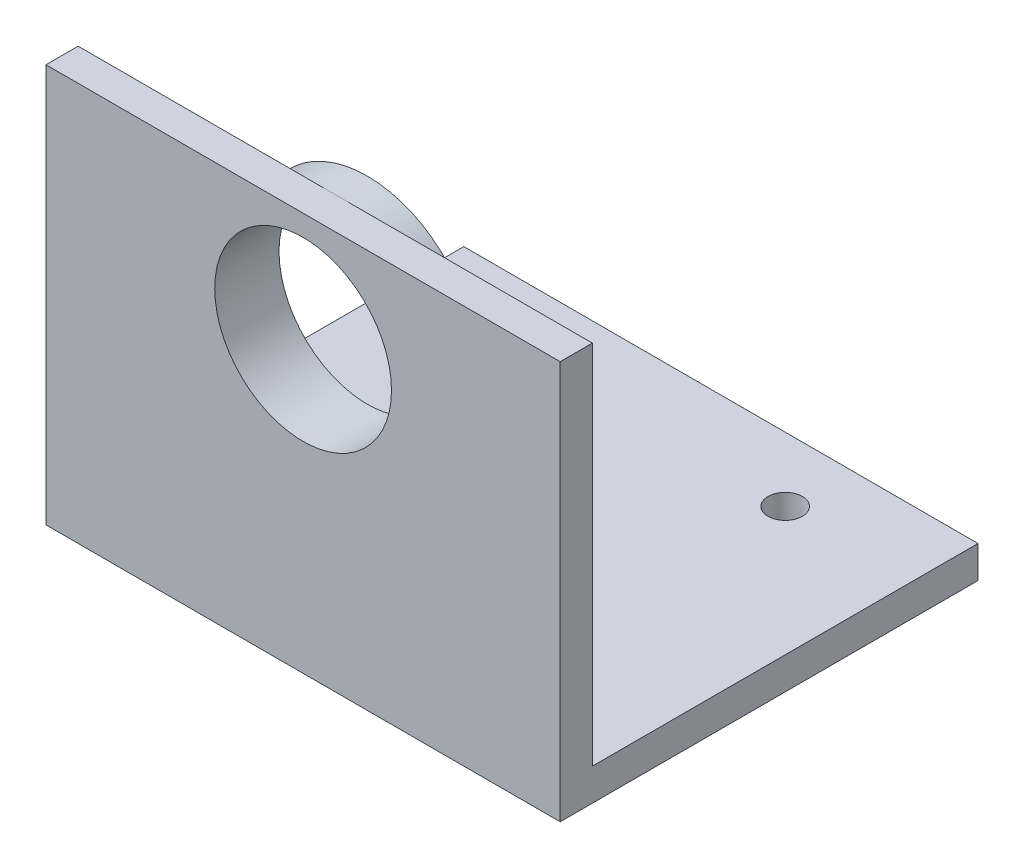
ISO-10303-21;
HEADER;
FILE_DESCRIPTION(('STEP AP214'),'2;1');
FILE_NAME('part.step','',(''),(''),'','','');
FILE_SCHEMA(('AUTOMOTIVE_DESIGN { 1 0 10303 214 1 1 1 1 }'));
ENDSEC;
DATA;
#1=APPLICATION_CONTEXT('core data for automotive mechanical design processes');
#2=APPLICATION_PROTOCOL_DEFINITION('international standard','automotive_design',2000,#1);
#3=PRODUCT_CONTEXT('',#1,'mechanical');
#4=PRODUCT('Part','Part','',(#3));
#5=PRODUCT_RELATED_PRODUCT_CATEGORY('part','',(#4));
#6=PRODUCT_DEFINITION_FORMATION('','',#4);
#7=PRODUCT_DEFINITION_CONTEXT('part definition',#1,'design');
#8=PRODUCT_DEFINITION('design','',#6,#7);
#9=PRODUCT_DEFINITION_SHAPE('','',#8);
#10=(LENGTH_UNIT() NAMED_UNIT(*) SI_UNIT(.MILLI.,.METRE.));
#11=(NAMED_UNIT(*) PLANE_ANGLE_UNIT() SI_UNIT($,.RADIAN.));
#12=(NAMED_UNIT(*) SI_UNIT($,.STERADIAN.) SOLID_ANGLE_UNIT());
#13=UNCERTAINTY_MEASURE_WITH_UNIT(LENGTH_MEASURE(1.E-05),#10,'distance_accuracy_value','');
#14=(GEOMETRIC_REPRESENTATION_CONTEXT(3) GLOBAL_UNCERTAINTY_ASSIGNED_CONTEXT((#13)) GLOBAL_UNIT_ASSIGNED_CONTEXT((#10,
#11,#12)) REPRESENTATION_CONTEXT('',''));
#15=CARTESIAN_POINT('',(0.,0.,0.));
#16=DIRECTION('',(0.,0.,1.));
#17=DIRECTION('',(1.,0.,0.));
#18=AXIS2_PLACEMENT_3D('',#15,#16,#17);
#19=CARTESIAN_POINT('',(0.,3.175,0.));
#20=DIRECTION('',(0.,-1.,0.));
#21=DIRECTION('',(0.,0.,-1.));
#22=AXIS2_PLACEMENT_3D('',#19,#20,#21);
#23=PLANE('',#22);
#24=CARTESIAN_POINT('',(12.7,3.175,-19.05));
#25=DIRECTION('',(0.,-1.,0.));
#26=DIRECTION('',(0.,0.,-1.));
#27=AXIS2_PLACEMENT_3D('',#24,#25,#26);
#28=CIRCLE('',#27,1.7);
#29=CARTESIAN_POINT('',(12.7,3.175,-20.75));
#30=VERTEX_POINT('',#29);
#31=EDGE_CURVE('E192',#30,#30,#28,.T.);
#32=ORIENTED_EDGE('',*,*,#31,.T.);
#33=EDGE_LOOP('',(#32));
#34=FACE_BOUND('',#33,.T.);
#35=CARTESIAN_POINT('',(-12.7,3.175,-19.05));
#36=DIRECTION('',(0.,-1.,0.));
#37=DIRECTION('',(0.,0.,-1.));
#38=AXIS2_PLACEMENT_3D('',#35,#36,#37);
#39=CIRCLE('',#38,1.7);
#40=CARTESIAN_POINT('',(-12.7,3.175,-20.75));
#41=VERTEX_POINT('',#40);
#42=EDGE_CURVE('E186',#41,#41,#39,.T.);
#43=ORIENTED_EDGE('',*,*,#42,.T.);
#44=EDGE_LOOP('',(#43));
#45=FACE_BOUND('',#44,.T.);
#46=DIRECTION('',(1.,0.,0.));
#47=VECTOR('',#46,1.);
#48=CARTESIAN_POINT('',(-25.4,3.175,12.7));
#49=LINE('',#48,#47);
#50=CARTESIAN_POINT('',(-25.4,3.175,12.7));
#51=VERTEX_POINT('',#50);
#52=CARTESIAN_POINT('',(-13.97,3.175,12.7));
#53=VERTEX_POINT('',#52);
#54=EDGE_CURVE('E206',#51,#53,#49,.T.);
#55=ORIENTED_EDGE('',*,*,#54,.T.);
#56=DIRECTION('',(0.,0.,1.));
#57=VECTOR('',#56,1.);
#58=CARTESIAN_POINT('',(-13.97,3.175,9.525));
#59=LINE('',#58,#57);
#60=CARTESIAN_POINT('',(-13.97,3.175,9.525));
#61=VERTEX_POINT('',#60);
#62=EDGE_CURVE('E228',#53,#61,#59,.F.);
#63=ORIENTED_EDGE('',*,*,#62,.T.);
#64=DIRECTION('',(-1.,0.,0.));
#65=VECTOR('',#64,1.);
#66=CARTESIAN_POINT('',(10.795,3.175,9.525));
#67=LINE('',#66,#65);
#68=CARTESIAN_POINT('',(13.97,3.175,9.525));
#69=VERTEX_POINT('',#68);
#70=EDGE_CURVE('E135',#69,#61,#67,.T.);
#71=ORIENTED_EDGE('',*,*,#70,.F.);
#72=DIRECTION('',(0.,0.,1.));
#73=VECTOR('',#72,1.);
#74=CARTESIAN_POINT('',(13.97,3.175,12.7));
#75=LINE('',#74,#73);
#76=CARTESIAN_POINT('',(13.97,3.175,12.7));
#77=VERTEX_POINT('',#76);
#78=EDGE_CURVE('E225',#69,#77,#75,.T.);
#79=ORIENTED_EDGE('',*,*,#78,.T.);
#80=CARTESIAN_POINT('',(25.4,3.175,12.7));
#81=VERTEX_POINT('',#80);
#82=EDGE_CURVE('E205',#77,#81,#49,.T.);
#83=ORIENTED_EDGE('',*,*,#82,.T.);
#84=DIRECTION('',(0.,0.,-1.));
#85=VECTOR('',#84,1.);
#86=CARTESIAN_POINT('',(25.4,3.175,-12.7));
#87=LINE('',#86,#85);
#88=CARTESIAN_POINT('',(25.4,3.175,-25.4));
#89=VERTEX_POINT('',#88);
#90=EDGE_CURVE('E196',#81,#89,#87,.T.);
#91=ORIENTED_EDGE('',*,*,#90,.T.);
#92=DIRECTION('',(-1.,0.,0.));
#93=VECTOR('',#92,1.);
#94=CARTESIAN_POINT('',(-25.4,3.175,-25.4));
#95=LINE('',#94,#93);
#96=CARTESIAN_POINT('',(-25.4,3.175,-25.4));
#97=VERTEX_POINT('',#96);
#98=EDGE_CURVE('E199',#89,#97,#95,.T.);
#99=ORIENTED_EDGE('',*,*,#98,.T.);
#100=DIRECTION('',(0.,0.,1.));
#101=VECTOR('',#100,1.);
#102=CARTESIAN_POINT('',(-25.4,3.175,-12.7));
#103=LINE('',#102,#101);
#104=EDGE_CURVE('E202',#97,#51,#103,.T.);
#105=ORIENTED_EDGE('',*,*,#104,.T.);
#106=EDGE_LOOP('',(#55,#63,#71,#79,#83,#91,#99,#105));
#107=FACE_BOUND('',#106,.T.);
#108=ADVANCED_FACE('F37',(#34,#45,#107),#23,.F.);
#109=CARTESIAN_POINT('',(-25.4,39.37,12.7));
#110=DIRECTION('',(0.,0.,-1.));
#111=DIRECTION('',(-1.,0.,0.));
#112=AXIS2_PLACEMENT_3D('',#109,#110,#111);
#113=PLANE('',#112);
#114=ORIENTED_EDGE('',*,*,#82,.F.);
#115=CARTESIAN_POINT('',(13.97,6.35,12.7));
#116=DIRECTION('',(0.,0.,-1.));
#117=DIRECTION('',(-1.,0.,0.));
#118=AXIS2_PLACEMENT_3D('',#115,#116,#117);
#119=CIRCLE('',#118,3.175);
#120=CARTESIAN_POINT('',(10.795,6.35,12.7));
#121=VERTEX_POINT('',#120);
#122=EDGE_CURVE('E60',#77,#121,#119,.T.);
#123=ORIENTED_EDGE('',*,*,#122,.T.);
#124=DIRECTION('',(0.,-1.,0.));
#125=VECTOR('',#124,1.);
#126=CARTESIAN_POINT('',(10.795,28.575,12.7));
#127=LINE('',#126,#125);
#128=CARTESIAN_POINT('',(10.795,28.575,12.7));
#129=VERTEX_POINT('',#128);
#130=EDGE_CURVE('E337',#129,#121,#127,.T.);
#131=ORIENTED_EDGE('',*,*,#130,.F.);
#132=CARTESIAN_POINT('',(0.,28.575,12.7));
#133=DIRECTION('',(0.,0.,-1.));
#134=DIRECTION('',(-1.,0.,0.));
#135=AXIS2_PLACEMENT_3D('',#132,#133,#134);
#136=CIRCLE('',#135,10.795);
#137=CARTESIAN_POINT('',(0.,39.37,12.7));
#138=VERTEX_POINT('',#137);
#139=EDGE_CURVE('E149',#138,#129,#136,.T.);
#140=ORIENTED_EDGE('',*,*,#139,.F.);
#141=DIRECTION('',(1.,0.,0.));
#142=VECTOR('',#141,1.);
#143=CARTESIAN_POINT('',(-25.4,39.37,12.7));
#144=LINE('',#143,#142);
#145=CARTESIAN_POINT('',(25.4,39.37,12.7));
#146=VERTEX_POINT('',#145);
#147=EDGE_CURVE('E161',#138,#146,#144,.T.);
#148=ORIENTED_EDGE('',*,*,#147,.T.);
#149=DIRECTION('',(0.,-1.,0.));
#150=VECTOR('',#149,1.);
#151=CARTESIAN_POINT('',(25.4,39.37,12.7));
#152=LINE('',#151,#150);
#153=EDGE_CURVE('E179',#146,#81,#152,.T.);
#154=ORIENTED_EDGE('',*,*,#153,.T.);
#155=EDGE_LOOP('',(#114,#123,#131,#140,#148,#154));
#156=FACE_BOUND('',#155,.T.);
#157=ADVANCED_FACE('F257',(#156),#113,.T.);
#158=DIRECTION('',(0.,1.,0.));
#159=VECTOR('',#158,1.);
#160=CARTESIAN_POINT('',(-10.795,3.175,12.7));
#161=LINE('',#160,#159);
#162=CARTESIAN_POINT('',(-10.795,6.35,12.7));
#163=VERTEX_POINT('',#162);
#164=CARTESIAN_POINT('',(-10.795,28.575,12.7));
#165=VERTEX_POINT('',#164);
#166=EDGE_CURVE('E145',#163,#165,#161,.T.);
#167=ORIENTED_EDGE('',*,*,#166,.F.);
#168=CARTESIAN_POINT('',(-13.97,6.35,12.7));
#169=DIRECTION('',(0.,0.,-1.));
#170=DIRECTION('',(-1.,0.,0.));
#171=AXIS2_PLACEMENT_3D('',#168,#169,#170);
#172=CIRCLE('',#171,3.175);
#173=EDGE_CURVE('E223',#163,#53,#172,.T.);
#174=ORIENTED_EDGE('',*,*,#173,.T.);
#175=ORIENTED_EDGE('',*,*,#54,.F.);
#176=DIRECTION('',(0.,-1.,0.));
#177=VECTOR('',#176,1.);
#178=CARTESIAN_POINT('',(-25.4,39.37,12.7));
#179=LINE('',#178,#177);
#180=CARTESIAN_POINT('',(-25.4,39.37,12.7));
#181=VERTEX_POINT('',#180);
#182=EDGE_CURVE('E170',#181,#51,#179,.T.);
#183=ORIENTED_EDGE('',*,*,#182,.F.);
#184=EDGE_CURVE('E162',#181,#138,#144,.T.);
#185=ORIENTED_EDGE('',*,*,#184,.T.);
#186=EDGE_CURVE('E335',#165,#138,#136,.T.);
#187=ORIENTED_EDGE('',*,*,#186,.F.);
#188=EDGE_LOOP('',(#167,#174,#175,#183,#185,#187));
#189=FACE_BOUND('',#188,.T.);
#190=ADVANCED_FACE('F242',(#189),#113,.T.);
#191=CARTESIAN_POINT('',(-25.4,3.175,-25.4));
#192=DIRECTION('',(0.,0.,1.));
#193=DIRECTION('',(1.,0.,0.));
#194=AXIS2_PLACEMENT_3D('',#191,#192,#193);
#195=PLANE('',#194);
#196=DIRECTION('',(-1.,0.,0.));
#197=VECTOR('',#196,1.);
#198=CARTESIAN_POINT('',(-25.4,0.,-25.4));
#199=LINE('',#198,#197);
#200=CARTESIAN_POINT('',(25.4,0.,-25.4));
#201=VERTEX_POINT('',#200);
#202=CARTESIAN_POINT('',(-25.4,0.,-25.4));
#203=VERTEX_POINT('',#202);
#204=EDGE_CURVE('E195',#201,#203,#199,.T.);
#205=ORIENTED_EDGE('',*,*,#204,.T.);
#206=DIRECTION('',(0.,-1.,0.));
#207=VECTOR('',#206,1.);
#208=CARTESIAN_POINT('',(-25.4,3.175,-25.4));
#209=LINE('',#208,#207);
#210=EDGE_CURVE('E209',#97,#203,#209,.T.);
#211=ORIENTED_EDGE('',*,*,#210,.F.);
#212=ORIENTED_EDGE('',*,*,#98,.F.);
#213=DIRECTION('',(0.,-1.,0.));
#214=VECTOR('',#213,1.);
#215=CARTESIAN_POINT('',(25.4,3.175,-25.4));
#216=LINE('',#215,#214);
#217=EDGE_CURVE('E217',#89,#201,#216,.T.);
#218=ORIENTED_EDGE('',*,*,#217,.T.);
#219=EDGE_LOOP('',(#205,#211,#212,#218));
#220=FACE_BOUND('',#219,.T.);
#221=ADVANCED_FACE('F289',(#220),#195,.F.);
#222=CARTESIAN_POINT('',(-25.4,3.175,12.7));
#223=DIRECTION('',(1.,0.,0.));
#224=DIRECTION('',(0.,0.,-1.));
#225=AXIS2_PLACEMENT_3D('',#222,#223,#224);
#226=PLANE('',#225);
#227=DIRECTION('',(0.,0.,1.));
#228=VECTOR('',#227,1.);
#229=CARTESIAN_POINT('',(-25.4,0.,12.7));
#230=LINE('',#229,#228);
#231=CARTESIAN_POINT('',(-25.4,0.,15.875));
#232=VERTEX_POINT('',#231);
#233=EDGE_CURVE('E212',#203,#232,#230,.T.);
#234=ORIENTED_EDGE('',*,*,#233,.T.);
#235=DIRECTION('',(0.,-1.,0.));
#236=VECTOR('',#235,1.);
#237=CARTESIAN_POINT('',(-25.4,39.37,15.875));
#238=LINE('',#237,#236);
#239=CARTESIAN_POINT('',(-25.4,39.37,15.875));
#240=VERTEX_POINT('',#239);
#241=EDGE_CURVE('E172',#240,#232,#238,.T.);
#242=ORIENTED_EDGE('',*,*,#241,.F.);
#243=DIRECTION('',(0.,0.,-1.));
#244=VECTOR('',#243,1.);
#245=CARTESIAN_POINT('',(-25.4,39.37,12.7));
#246=LINE('',#245,#244);
#247=EDGE_CURVE('E154',#240,#181,#246,.T.);
#248=ORIENTED_EDGE('',*,*,#247,.T.);
#249=ORIENTED_EDGE('',*,*,#182,.T.);
#250=ORIENTED_EDGE('',*,*,#104,.F.);
#251=ORIENTED_EDGE('',*,*,#210,.T.);
#252=EDGE_LOOP('',(#234,#242,#248,#249,#250,#251));
#253=FACE_BOUND('',#252,.T.);
#254=ADVANCED_FACE('F248',(#253),#226,.F.);
#255=CARTESIAN_POINT('',(25.4,3.175,12.7));
#256=DIRECTION('',(-1.,0.,0.));
#257=DIRECTION('',(0.,0.,1.));
#258=AXIS2_PLACEMENT_3D('',#255,#256,#257);
#259=PLANE('',#258);
#260=DIRECTION('',(0.,0.,-1.));
#261=VECTOR('',#260,1.);
#262=CARTESIAN_POINT('',(25.4,0.,12.7));
#263=LINE('',#262,#261);
#264=CARTESIAN_POINT('',(25.4,0.,15.875));
#265=VERTEX_POINT('',#264);
#266=EDGE_CURVE('E200',#265,#201,#263,.T.);
#267=ORIENTED_EDGE('',*,*,#266,.T.);
#268=ORIENTED_EDGE('',*,*,#217,.F.);
#269=ORIENTED_EDGE('',*,*,#90,.F.);
#270=ORIENTED_EDGE('',*,*,#153,.F.);
#271=DIRECTION('',(0.,0.,1.));
#272=VECTOR('',#271,1.);
#273=CARTESIAN_POINT('',(25.4,39.37,12.7));
#274=LINE('',#273,#272);
#275=CARTESIAN_POINT('',(25.4,39.37,15.875));
#276=VERTEX_POINT('',#275);
#277=EDGE_CURVE('E165',#146,#276,#274,.T.);
#278=ORIENTED_EDGE('',*,*,#277,.T.);
#279=DIRECTION('',(0.,-1.,0.));
#280=VECTOR('',#279,1.);
#281=CARTESIAN_POINT('',(25.4,39.37,15.875));
#282=LINE('',#281,#280);
#283=EDGE_CURVE('E176',#276,#265,#282,.T.);
#284=ORIENTED_EDGE('',*,*,#283,.T.);
#285=EDGE_LOOP('',(#267,#268,#269,#270,#278,#284));
#286=FACE_BOUND('',#285,.T.);
#287=ADVANCED_FACE('F260',(#286),#259,.F.);
#288=CARTESIAN_POINT('',(0.,0.,0.));
#289=DIRECTION('',(0.,-1.,0.));
#290=DIRECTION('',(0.,0.,-1.));
#291=AXIS2_PLACEMENT_3D('',#288,#289,#290);
#292=PLANE('',#291);
#293=CARTESIAN_POINT('',(-12.7,0.,-19.05));
#294=DIRECTION('',(0.,-1.,0.));
#295=DIRECTION('',(0.,0.,-1.));
#296=AXIS2_PLACEMENT_3D('',#293,#294,#295);
#297=CIRCLE('',#296,1.69999999999999);
#298=CARTESIAN_POINT('',(-12.7,0.,-20.75));
#299=VERTEX_POINT('',#298);
#300=EDGE_CURVE('E175',#299,#299,#297,.T.);
#301=ORIENTED_EDGE('',*,*,#300,.F.);
#302=EDGE_LOOP('',(#301));
#303=FACE_BOUND('',#302,.T.);
#304=CARTESIAN_POINT('',(12.7,0.,-19.05));
#305=DIRECTION('',(0.,-1.,0.));
#306=DIRECTION('',(0.,0.,-1.));
#307=AXIS2_PLACEMENT_3D('',#304,#305,#306);
#308=CIRCLE('',#307,1.69999999999999);
#309=CARTESIAN_POINT('',(12.7,0.,-20.75));
#310=VERTEX_POINT('',#309);
#311=EDGE_CURVE('E189',#310,#310,#308,.T.);
#312=ORIENTED_EDGE('',*,*,#311,.F.);
#313=EDGE_LOOP('',(#312));
#314=FACE_BOUND('',#313,.T.);
#315=ORIENTED_EDGE('',*,*,#204,.F.);
#316=ORIENTED_EDGE('',*,*,#266,.F.);
#317=DIRECTION('',(-1.,0.,0.));
#318=VECTOR('',#317,1.);
#319=CARTESIAN_POINT('',(-25.4,0.,15.875));
#320=LINE('',#319,#318);
#321=EDGE_CURVE('E150',#265,#232,#320,.T.);
#322=ORIENTED_EDGE('',*,*,#321,.T.);
#323=ORIENTED_EDGE('',*,*,#233,.F.);
#324=EDGE_LOOP('',(#315,#316,#322,#323));
#325=FACE_BOUND('',#324,.T.);
#326=ADVANCED_FACE('F281',(#303,#314,#325),#292,.T.);
#327=CARTESIAN_POINT('',(12.7,0.,-19.05));
#328=DIRECTION('',(0.,-1.,0.));
#329=DIRECTION('',(0.,0.,-1.));
#330=AXIS2_PLACEMENT_3D('',#327,#328,#329);
#331=CYLINDRICAL_SURFACE('',#330,1.7);
#332=ORIENTED_EDGE('',*,*,#31,.F.);
#333=EDGE_LOOP('',(#332));
#334=FACE_BOUND('',#333,.T.);
#335=ORIENTED_EDGE('',*,*,#311,.T.);
#336=EDGE_LOOP('',(#335));
#337=FACE_BOUND('',#336,.T.);
#338=ADVANCED_FACE('F279',(#334,#337),#331,.F.);
#339=CARTESIAN_POINT('',(-12.7,0.,-19.05));
#340=DIRECTION('',(0.,-1.,0.));
#341=DIRECTION('',(0.,0.,-1.));
#342=AXIS2_PLACEMENT_3D('',#339,#340,#341);
#343=CYLINDRICAL_SURFACE('',#342,1.7);
#344=ORIENTED_EDGE('',*,*,#42,.F.);
#345=EDGE_LOOP('',(#344));
#346=FACE_BOUND('',#345,.T.);
#347=ORIENTED_EDGE('',*,*,#300,.T.);
#348=EDGE_LOOP('',(#347));
#349=FACE_BOUND('',#348,.T.);
#350=ADVANCED_FACE('F301',(#346,#349),#343,.F.);
#351=CARTESIAN_POINT('',(-25.4,39.37,15.875));
#352=DIRECTION('',(0.,0.,1.));
#353=DIRECTION('',(1.,0.,0.));
#354=AXIS2_PLACEMENT_3D('',#351,#352,#353);
#355=PLANE('',#354);
#356=CARTESIAN_POINT('',(0.,28.575,15.875));
#357=DIRECTION('',(0.,0.,-1.));
#358=DIRECTION('',(-1.,0.,0.));
#359=AXIS2_PLACEMENT_3D('',#356,#357,#358);
#360=CIRCLE('',#359,8.73125);
#361=CARTESIAN_POINT('',(-8.73125,28.575,15.875));
#362=VERTEX_POINT('',#361);
#363=EDGE_CURVE('E327',#362,#362,#360,.T.);
#364=ORIENTED_EDGE('',*,*,#363,.T.);
#365=EDGE_LOOP('',(#364));
#366=FACE_BOUND('',#365,.T.);
#367=ORIENTED_EDGE('',*,*,#321,.F.);
#368=ORIENTED_EDGE('',*,*,#283,.F.);
#369=DIRECTION('',(-1.,0.,0.));
#370=VECTOR('',#369,1.);
#371=CARTESIAN_POINT('',(-25.4,39.37,15.875));
#372=LINE('',#371,#370);
#373=EDGE_CURVE('E168',#276,#240,#372,.T.);
#374=ORIENTED_EDGE('',*,*,#373,.T.);
#375=ORIENTED_EDGE('',*,*,#241,.T.);
#376=EDGE_LOOP('',(#367,#368,#374,#375));
#377=FACE_BOUND('',#376,.T.);
#378=ADVANCED_FACE('F299',(#366,#377),#355,.T.);
#379=CARTESIAN_POINT('',(0.,39.37,0.));
#380=DIRECTION('',(0.,1.,0.));
#381=DIRECTION('',(0.,0.,1.));
#382=AXIS2_PLACEMENT_3D('',#379,#380,#381);
#383=PLANE('',#382);
#384=ORIENTED_EDGE('',*,*,#247,.F.);
#385=ORIENTED_EDGE('',*,*,#373,.F.);
#386=ORIENTED_EDGE('',*,*,#277,.F.);
#387=ORIENTED_EDGE('',*,*,#147,.F.);
#388=ORIENTED_EDGE('',*,*,#184,.F.);
#389=EDGE_LOOP('',(#384,#385,#386,#387,#388));
#390=FACE_BOUND('',#389,.T.);
#391=ADVANCED_FACE('F253',(#390),#383,.T.);
#392=CARTESIAN_POINT('',(0.,28.575,9.525));
#393=DIRECTION('',(0.,0.,1.));
#394=DIRECTION('',(1.,0.,0.));
#395=AXIS2_PLACEMENT_3D('',#392,#393,#394);
#396=CYLINDRICAL_SURFACE('',#395,10.795);
#397=ORIENTED_EDGE('',*,*,#186,.T.);
#398=ORIENTED_EDGE('',*,*,#139,.T.);
#399=DIRECTION('',(0.,0.,1.));
#400=VECTOR('',#399,1.);
#401=CARTESIAN_POINT('',(10.795,28.575,9.525));
#402=LINE('',#401,#400);
#403=CARTESIAN_POINT('',(10.795,28.575,9.525));
#404=VERTEX_POINT('',#403);
#405=EDGE_CURVE('E132',#404,#129,#402,.T.);
#406=ORIENTED_EDGE('',*,*,#405,.F.);
#407=CARTESIAN_POINT('',(0.,28.575,9.525));
#408=DIRECTION('',(0.,0.,-1.));
#409=DIRECTION('',(-1.,0.,0.));
#410=AXIS2_PLACEMENT_3D('',#407,#408,#409);
#411=CIRCLE('',#410,10.795);
#412=CARTESIAN_POINT('',(-10.795,28.575,9.525));
#413=VERTEX_POINT('',#412);
#414=EDGE_CURVE('E136',#413,#404,#411,.T.);
#415=ORIENTED_EDGE('',*,*,#414,.F.);
#416=DIRECTION('',(0.,0.,1.));
#417=VECTOR('',#416,1.);
#418=CARTESIAN_POINT('',(-10.795,28.575,9.525));
#419=LINE('',#418,#417);
#420=EDGE_CURVE('E151',#413,#165,#419,.T.);
#421=ORIENTED_EDGE('',*,*,#420,.T.);
#422=EDGE_LOOP('',(#397,#398,#406,#415,#421));
#423=FACE_BOUND('',#422,.T.);
#424=ADVANCED_FACE('F147',(#423),#396,.T.);
#425=CARTESIAN_POINT('',(10.795,28.575,9.525));
#426=DIRECTION('',(-1.,0.,0.));
#427=DIRECTION('',(0.,-1.,0.));
#428=AXIS2_PLACEMENT_3D('',#425,#426,#427);
#429=PLANE('',#428);
#430=ORIENTED_EDGE('',*,*,#130,.T.);
#431=DIRECTION('',(0.,0.,1.));
#432=VECTOR('',#431,1.);
#433=CARTESIAN_POINT('',(10.795,6.35,9.525));
#434=LINE('',#433,#432);
#435=CARTESIAN_POINT('',(10.795,6.35,9.525));
#436=VERTEX_POINT('',#435);
#437=EDGE_CURVE('E52',#121,#436,#434,.F.);
#438=ORIENTED_EDGE('',*,*,#437,.T.);
#439=DIRECTION('',(0.,-1.,0.));
#440=VECTOR('',#439,1.);
#441=CARTESIAN_POINT('',(10.795,28.575,9.525));
#442=LINE('',#441,#440);
#443=EDGE_CURVE('E128',#404,#436,#442,.T.);
#444=ORIENTED_EDGE('',*,*,#443,.F.);
#445=ORIENTED_EDGE('',*,*,#405,.T.);
#446=EDGE_LOOP('',(#430,#438,#444,#445));
#447=FACE_BOUND('',#446,.T.);
#448=ADVANCED_FACE('F130',(#447),#429,.F.);
#449=CARTESIAN_POINT('',(-10.795,3.175,9.525));
#450=DIRECTION('',(1.,0.,0.));
#451=DIRECTION('',(0.,1.,0.));
#452=AXIS2_PLACEMENT_3D('',#449,#450,#451);
#453=PLANE('',#452);
#454=DIRECTION('',(0.,1.,0.));
#455=VECTOR('',#454,1.);
#456=CARTESIAN_POINT('',(-10.795,3.175,9.525));
#457=LINE('',#456,#455);
#458=CARTESIAN_POINT('',(-10.795,6.35,9.525));
#459=VERTEX_POINT('',#458);
#460=EDGE_CURVE('E141',#459,#413,#457,.T.);
#461=ORIENTED_EDGE('',*,*,#460,.F.);
#462=DIRECTION('',(0.,0.,1.));
#463=VECTOR('',#462,1.);
#464=CARTESIAN_POINT('',(-10.795,6.35,12.7));
#465=LINE('',#464,#463);
#466=EDGE_CURVE('E220',#459,#163,#465,.T.);
#467=ORIENTED_EDGE('',*,*,#466,.T.);
#468=ORIENTED_EDGE('',*,*,#166,.T.);
#469=ORIENTED_EDGE('',*,*,#420,.F.);
#470=EDGE_LOOP('',(#461,#467,#468,#469));
#471=FACE_BOUND('',#470,.T.);
#472=ADVANCED_FACE('F237',(#471),#453,.F.);
#473=CARTESIAN_POINT('',(0.,28.575,9.525));
#474=DIRECTION('',(0.,0.,-1.));
#475=DIRECTION('',(-1.,0.,0.));
#476=AXIS2_PLACEMENT_3D('',#473,#474,#475);
#477=PLANE('',#476);
#478=CARTESIAN_POINT('',(0.,28.575,9.525));
#479=DIRECTION('',(0.,0.,-1.));
#480=DIRECTION('',(-1.,0.,0.));
#481=AXIS2_PLACEMENT_3D('',#478,#479,#480);
#482=CIRCLE('',#481,8.73125);
#483=CARTESIAN_POINT('',(-8.73125,28.575,9.525));
#484=VERTEX_POINT('',#483);
#485=EDGE_CURVE('E330',#484,#484,#482,.T.);
#486=ORIENTED_EDGE('',*,*,#485,.F.);
#487=EDGE_LOOP('',(#486));
#488=FACE_BOUND('',#487,.T.);
#489=ORIENTED_EDGE('',*,*,#414,.T.);
#490=ORIENTED_EDGE('',*,*,#443,.T.);
#491=CARTESIAN_POINT('',(13.97,6.35,9.525));
#492=DIRECTION('',(0.,0.,-1.));
#493=DIRECTION('',(-1.,0.,0.));
#494=AXIS2_PLACEMENT_3D('',#491,#492,#493);
#495=CIRCLE('',#494,3.175);
#496=EDGE_CURVE('E11',#436,#69,#495,.F.);
#497=ORIENTED_EDGE('',*,*,#496,.T.);
#498=ORIENTED_EDGE('',*,*,#70,.T.);
#499=CARTESIAN_POINT('',(-13.97,6.35,9.525));
#500=DIRECTION('',(0.,0.,-1.));
#501=DIRECTION('',(-1.,0.,0.));
#502=AXIS2_PLACEMENT_3D('',#499,#500,#501);
#503=CIRCLE('',#502,3.175);
#504=EDGE_CURVE('E45',#61,#459,#503,.F.);
#505=ORIENTED_EDGE('',*,*,#504,.T.);
#506=ORIENTED_EDGE('',*,*,#460,.T.);
#507=EDGE_LOOP('',(#489,#490,#497,#498,#505,#506));
#508=FACE_BOUND('',#507,.T.);
#509=ADVANCED_FACE('F139',(#488,#508),#477,.T.);
#510=CARTESIAN_POINT('',(0.,28.575,15.875));
#511=DIRECTION('',(0.,0.,-1.));
#512=DIRECTION('',(-1.,0.,0.));
#513=AXIS2_PLACEMENT_3D('',#510,#511,#512);
#514=CYLINDRICAL_SURFACE('',#513,8.73125);
#515=ORIENTED_EDGE('',*,*,#363,.F.);
#516=EDGE_LOOP('',(#515));
#517=FACE_BOUND('',#516,.T.);
#518=ORIENTED_EDGE('',*,*,#485,.T.);
#519=EDGE_LOOP('',(#518));
#520=FACE_BOUND('',#519,.T.);
#521=ADVANCED_FACE('F268',(#517,#520),#514,.F.);
#522=CARTESIAN_POINT('',(-13.97,6.35,9.525));
#523=DIRECTION('',(0.,0.,-1.));
#524=DIRECTION('',(-1.,0.,0.));
#525=AXIS2_PLACEMENT_3D('',#522,#523,#524);
#526=CYLINDRICAL_SURFACE('',#525,3.175);
#527=ORIENTED_EDGE('',*,*,#504,.F.);
#528=ORIENTED_EDGE('',*,*,#62,.F.);
#529=ORIENTED_EDGE('',*,*,#173,.F.);
#530=ORIENTED_EDGE('',*,*,#466,.F.);
#531=EDGE_LOOP('',(#527,#528,#529,#530));
#532=FACE_BOUND('',#531,.T.);
#533=ADVANCED_FACE('F240',(#532),#526,.F.);
#534=CARTESIAN_POINT('',(13.97,6.35,0.));
#535=DIRECTION('',(0.,0.,-1.));
#536=DIRECTION('',(-1.,0.,0.));
#537=AXIS2_PLACEMENT_3D('',#534,#535,#536);
#538=CYLINDRICAL_SURFACE('',#537,3.175);
#539=ORIENTED_EDGE('',*,*,#496,.F.);
#540=ORIENTED_EDGE('',*,*,#437,.F.);
#541=ORIENTED_EDGE('',*,*,#122,.F.);
#542=ORIENTED_EDGE('',*,*,#78,.F.);
#543=EDGE_LOOP('',(#539,#540,#541,#542));
#544=FACE_BOUND('',#543,.T.);
#545=ADVANCED_FACE('F39',(#544),#538,.F.);
#546=CLOSED_SHELL('',(#108,#157,#190,#221,#254,#287,#326,#338,#350,#378,#391,#424,#448,#472,
#509,#521,#533,#545));
#547=MANIFOLD_SOLID_BREP('B2',#546);
#548=ADVANCED_BREP_SHAPE_REPRESENTATION('',(#18,#547),#14);
#549=SHAPE_DEFINITION_REPRESENTATION(#9,#548);
ENDSEC;
END-ISO-10303-21;
